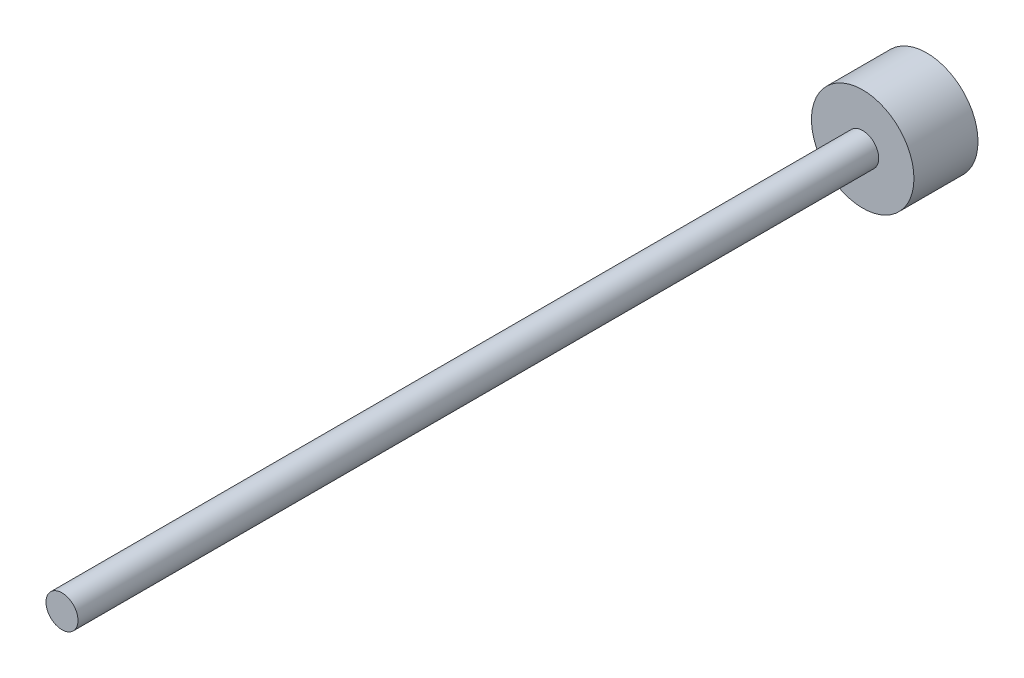
ISO-10303-21;
HEADER;
FILE_DESCRIPTION(('STEP AP214'),'2;1');
FILE_NAME('part.step','',(''),(''),'','','');
FILE_SCHEMA(('AUTOMOTIVE_DESIGN { 1 0 10303 214 1 1 1 1 }'));
ENDSEC;
DATA;
#1=APPLICATION_CONTEXT('core data for automotive mechanical design processes');
#2=APPLICATION_PROTOCOL_DEFINITION('international standard','automotive_design',2000,#1);
#3=PRODUCT_CONTEXT('',#1,'mechanical');
#4=PRODUCT('Part','Part','',(#3));
#5=PRODUCT_RELATED_PRODUCT_CATEGORY('part','',(#4));
#6=PRODUCT_DEFINITION_FORMATION('','',#4);
#7=PRODUCT_DEFINITION_CONTEXT('part definition',#1,'design');
#8=PRODUCT_DEFINITION('design','',#6,#7);
#9=PRODUCT_DEFINITION_SHAPE('','',#8);
#10=(LENGTH_UNIT() NAMED_UNIT(*) SI_UNIT(.MILLI.,.METRE.));
#11=(NAMED_UNIT(*) PLANE_ANGLE_UNIT() SI_UNIT($,.RADIAN.));
#12=(NAMED_UNIT(*) SI_UNIT($,.STERADIAN.) SOLID_ANGLE_UNIT());
#13=UNCERTAINTY_MEASURE_WITH_UNIT(LENGTH_MEASURE(1.E-05),#10,'distance_accuracy_value','');
#14=(GEOMETRIC_REPRESENTATION_CONTEXT(3) GLOBAL_UNCERTAINTY_ASSIGNED_CONTEXT((#13)) GLOBAL_UNIT_ASSIGNED_CONTEXT((#10,
#11,#12)) REPRESENTATION_CONTEXT('',''));
#15=CARTESIAN_POINT('',(0.,0.,0.));
#16=DIRECTION('',(0.,0.,1.));
#17=DIRECTION('',(1.,0.,0.));
#18=AXIS2_PLACEMENT_3D('',#15,#16,#17);
#19=CARTESIAN_POINT('',(0.,0.,10.));
#20=DIRECTION('',(0.,0.,1.));
#21=DIRECTION('',(1.,0.,0.));
#22=AXIS2_PLACEMENT_3D('',#19,#20,#21);
#23=PLANE('',#22);
#24=CARTESIAN_POINT('',(0.,0.,10.));
#25=DIRECTION('',(0.,0.,1.));
#26=DIRECTION('',(1.,0.,0.));
#27=AXIS2_PLACEMENT_3D('',#24,#25,#26);
#28=CIRCLE('',#27,8.);
#29=CARTESIAN_POINT('',(8.,0.,10.));
#30=VERTEX_POINT('',#29);
#31=EDGE_CURVE('E10',#30,#30,#28,.T.);
#32=ORIENTED_EDGE('',*,*,#31,.T.);
#33=EDGE_LOOP('',(#32));
#34=FACE_BOUND('',#33,.T.);
#35=CARTESIAN_POINT('',(0.,0.,10.));
#36=DIRECTION('',(0.,0.,1.));
#37=DIRECTION('',(1.,0.,0.));
#38=AXIS2_PLACEMENT_3D('',#35,#36,#37);
#39=CIRCLE('',#38,2.5);
#40=CARTESIAN_POINT('',(2.5,0.,10.));
#41=VERTEX_POINT('',#40);
#42=EDGE_CURVE('E47',#41,#41,#39,.T.);
#43=ORIENTED_EDGE('',*,*,#42,.F.);
#44=EDGE_LOOP('',(#43));
#45=FACE_BOUND('',#44,.T.);
#46=ADVANCED_FACE('F34',(#34,#45),#23,.T.);
#47=CARTESIAN_POINT('',(0.,0.,10.));
#48=DIRECTION('',(0.,0.,-1.));
#49=DIRECTION('',(-1.,0.,0.));
#50=AXIS2_PLACEMENT_3D('',#47,#48,#49);
#51=CYLINDRICAL_SURFACE('',#50,8.);
#52=ORIENTED_EDGE('',*,*,#31,.F.);
#53=EDGE_LOOP('',(#52));
#54=FACE_BOUND('',#53,.T.);
#55=CARTESIAN_POINT('',(0.,0.,0.));
#56=DIRECTION('',(0.,0.,1.));
#57=DIRECTION('',(1.,0.,0.));
#58=AXIS2_PLACEMENT_3D('',#55,#56,#57);
#59=CIRCLE('',#58,8.);
#60=CARTESIAN_POINT('',(8.,0.,0.));
#61=VERTEX_POINT('',#60);
#62=EDGE_CURVE('E38',#61,#61,#59,.T.);
#63=ORIENTED_EDGE('',*,*,#62,.T.);
#64=EDGE_LOOP('',(#63));
#65=FACE_BOUND('',#64,.T.);
#66=ADVANCED_FACE('F36',(#54,#65),#51,.T.);
#67=CARTESIAN_POINT('',(0.,0.,0.));
#68=DIRECTION('',(0.,0.,1.));
#69=DIRECTION('',(1.,0.,0.));
#70=AXIS2_PLACEMENT_3D('',#67,#68,#69);
#71=PLANE('',#70);
#72=ORIENTED_EDGE('',*,*,#62,.F.);
#73=EDGE_LOOP('',(#72));
#74=FACE_BOUND('',#73,.T.);
#75=ADVANCED_FACE('F58',(#74),#71,.F.);
#76=CARTESIAN_POINT('',(0.,0.,135.));
#77=DIRECTION('',(0.,0.,-1.));
#78=DIRECTION('',(-1.,0.,0.));
#79=AXIS2_PLACEMENT_3D('',#76,#77,#78);
#80=CYLINDRICAL_SURFACE('',#79,2.5);
#81=CARTESIAN_POINT('',(0.,0.,135.));
#82=DIRECTION('',(0.,0.,1.));
#83=DIRECTION('',(1.,0.,0.));
#84=AXIS2_PLACEMENT_3D('',#81,#82,#83);
#85=CIRCLE('',#84,2.5);
#86=CARTESIAN_POINT('',(2.5,0.,135.));
#87=VERTEX_POINT('',#86);
#88=EDGE_CURVE('E45',#87,#87,#85,.T.);
#89=ORIENTED_EDGE('',*,*,#88,.F.);
#90=EDGE_LOOP('',(#89));
#91=FACE_BOUND('',#90,.T.);
#92=ORIENTED_EDGE('',*,*,#42,.T.);
#93=EDGE_LOOP('',(#92));
#94=FACE_BOUND('',#93,.T.);
#95=ADVANCED_FACE('F55',(#91,#94),#80,.T.);
#96=CARTESIAN_POINT('',(0.,0.,135.));
#97=DIRECTION('',(0.,0.,1.));
#98=DIRECTION('',(1.,0.,0.));
#99=AXIS2_PLACEMENT_3D('',#96,#97,#98);
#100=PLANE('',#99);
#101=ORIENTED_EDGE('',*,*,#88,.T.);
#102=EDGE_LOOP('',(#101));
#103=FACE_BOUND('',#102,.T.);
#104=ADVANCED_FACE('F53',(#103),#100,.T.);
#105=CLOSED_SHELL('',(#46,#66,#75,#95,#104));
#106=MANIFOLD_SOLID_BREP('B2',#105);
#107=ADVANCED_BREP_SHAPE_REPRESENTATION('',(#18,#106),#14);
#108=SHAPE_DEFINITION_REPRESENTATION(#9,#107);
ENDSEC;
END-ISO-10303-21;
